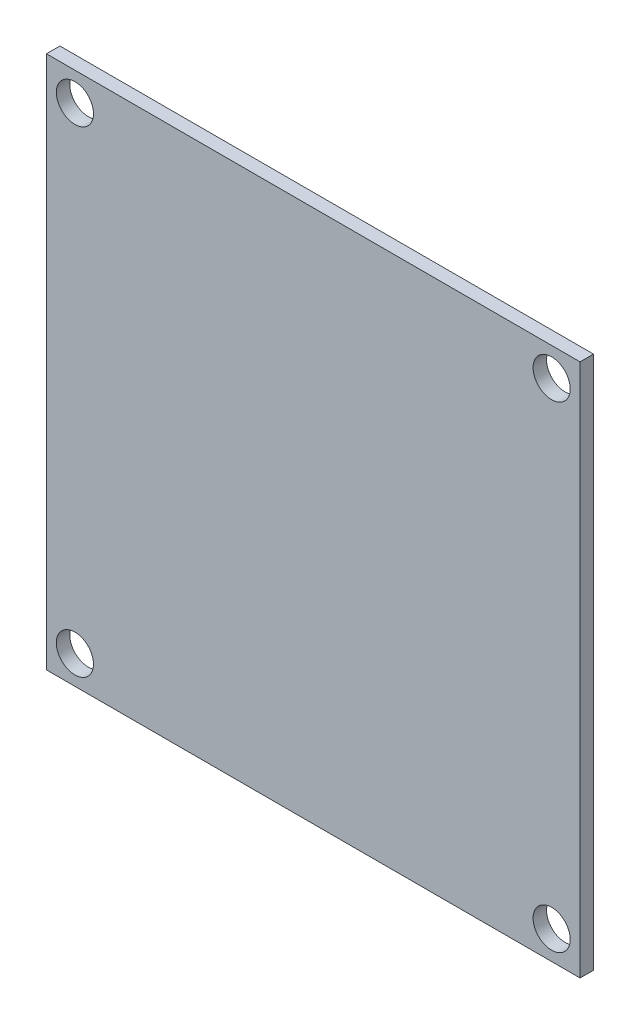
ISO-10303-21;
HEADER;
FILE_DESCRIPTION(('STEP AP214'),'2;1');
FILE_NAME('part.step','',(''),(''),'','','');
FILE_SCHEMA(('AUTOMOTIVE_DESIGN { 1 0 10303 214 1 1 1 1 }'));
ENDSEC;
DATA;
#1=APPLICATION_CONTEXT('core data for automotive mechanical design processes');
#2=APPLICATION_PROTOCOL_DEFINITION('international standard','automotive_design',2000,#1);
#3=PRODUCT_CONTEXT('',#1,'mechanical');
#4=PRODUCT('Part','Part','',(#3));
#5=PRODUCT_RELATED_PRODUCT_CATEGORY('part','',(#4));
#6=PRODUCT_DEFINITION_FORMATION('','',#4);
#7=PRODUCT_DEFINITION_CONTEXT('part definition',#1,'design');
#8=PRODUCT_DEFINITION('design','',#6,#7);
#9=PRODUCT_DEFINITION_SHAPE('','',#8);
#10=(LENGTH_UNIT() NAMED_UNIT(*) SI_UNIT(.MILLI.,.METRE.));
#11=(NAMED_UNIT(*) PLANE_ANGLE_UNIT() SI_UNIT($,.RADIAN.));
#12=(NAMED_UNIT(*) SI_UNIT($,.STERADIAN.) SOLID_ANGLE_UNIT());
#13=UNCERTAINTY_MEASURE_WITH_UNIT(LENGTH_MEASURE(1.E-05),#10,'distance_accuracy_value','');
#14=(GEOMETRIC_REPRESENTATION_CONTEXT(3) GLOBAL_UNCERTAINTY_ASSIGNED_CONTEXT((#13)) GLOBAL_UNIT_ASSIGNED_CONTEXT((#10,
#11,#12)) REPRESENTATION_CONTEXT('',''));
#15=CARTESIAN_POINT('',(0.,0.,0.));
#16=DIRECTION('',(0.,0.,1.));
#17=DIRECTION('',(1.,0.,0.));
#18=AXIS2_PLACEMENT_3D('',#15,#16,#17);
#19=CARTESIAN_POINT('',(25.1841,25.1841,1.27));
#20=DIRECTION('',(0.,0.,-1.));
#21=DIRECTION('',(-1.,0.,0.));
#22=AXIS2_PLACEMENT_3D('',#19,#20,#21);
#23=PLANE('',#22);
#24=CARTESIAN_POINT('',(-22.5,-22.5,1.27));
#25=DIRECTION('',(0.,0.,1.));
#26=DIRECTION('',(1.,0.,0.));
#27=AXIS2_PLACEMENT_3D('',#24,#25,#26);
#28=CIRCLE('',#27,1.7526);
#29=CARTESIAN_POINT('',(-20.7474,-22.5,1.27));
#30=VERTEX_POINT('',#29);
#31=EDGE_CURVE('E121',#30,#30,#28,.T.);
#32=ORIENTED_EDGE('',*,*,#31,.F.);
#33=EDGE_LOOP('',(#32));
#34=FACE_BOUND('',#33,.T.);
#35=CARTESIAN_POINT('',(-22.5,22.5,1.27));
#36=DIRECTION('',(0.,0.,1.));
#37=DIRECTION('',(1.,0.,0.));
#38=AXIS2_PLACEMENT_3D('',#35,#36,#37);
#39=CIRCLE('',#38,1.7526);
#40=CARTESIAN_POINT('',(-20.7474,22.5,1.27));
#41=VERTEX_POINT('',#40);
#42=EDGE_CURVE('E100',#41,#41,#39,.T.);
#43=ORIENTED_EDGE('',*,*,#42,.F.);
#44=EDGE_LOOP('',(#43));
#45=FACE_BOUND('',#44,.T.);
#46=DIRECTION('',(0.,1.,0.));
#47=VECTOR('',#46,1.);
#48=CARTESIAN_POINT('',(25.1841,-25.1841,1.27));
#49=LINE('',#48,#47);
#50=CARTESIAN_POINT('',(25.1841,-25.1841,1.27));
#51=VERTEX_POINT('',#50);
#52=CARTESIAN_POINT('',(25.1841,25.1841,1.27));
#53=VERTEX_POINT('',#52);
#54=EDGE_CURVE('E85',#51,#53,#49,.T.);
#55=ORIENTED_EDGE('',*,*,#54,.T.);
#56=DIRECTION('',(-1.,0.,0.));
#57=VECTOR('',#56,1.);
#58=CARTESIAN_POINT('',(-25.1841,25.1841,1.27));
#59=LINE('',#58,#57);
#60=CARTESIAN_POINT('',(-25.1841,25.1841,1.27));
#61=VERTEX_POINT('',#60);
#62=EDGE_CURVE('E80',#53,#61,#59,.T.);
#63=ORIENTED_EDGE('',*,*,#62,.T.);
#64=DIRECTION('',(0.,-1.,0.));
#65=VECTOR('',#64,1.);
#66=CARTESIAN_POINT('',(-25.1841,-25.1841,1.27));
#67=LINE('',#66,#65);
#68=CARTESIAN_POINT('',(-25.1841,-25.1841,1.27));
#69=VERTEX_POINT('',#68);
#70=EDGE_CURVE('E83',#61,#69,#67,.T.);
#71=ORIENTED_EDGE('',*,*,#70,.T.);
#72=DIRECTION('',(1.,0.,0.));
#73=VECTOR('',#72,1.);
#74=CARTESIAN_POINT('',(-25.1841,-25.1841,1.27));
#75=LINE('',#74,#73);
#76=EDGE_CURVE('E50',#69,#51,#75,.T.);
#77=ORIENTED_EDGE('',*,*,#76,.T.);
#78=EDGE_LOOP('',(#55,#63,#71,#77));
#79=FACE_BOUND('',#78,.T.);
#80=CARTESIAN_POINT('',(22.5,22.5,1.27));
#81=DIRECTION('',(0.,0.,1.));
#82=DIRECTION('',(1.,0.,0.));
#83=AXIS2_PLACEMENT_3D('',#80,#81,#82);
#84=CIRCLE('',#83,1.7526);
#85=CARTESIAN_POINT('',(24.2526,22.5,1.27));
#86=VERTEX_POINT('',#85);
#87=EDGE_CURVE('E115',#86,#86,#84,.T.);
#88=ORIENTED_EDGE('',*,*,#87,.F.);
#89=EDGE_LOOP('',(#88));
#90=FACE_BOUND('',#89,.T.);
#91=CARTESIAN_POINT('',(22.5,-22.5,1.27));
#92=DIRECTION('',(0.,0.,1.));
#93=DIRECTION('',(1.,0.,0.));
#94=AXIS2_PLACEMENT_3D('',#91,#92,#93);
#95=CIRCLE('',#94,1.7526);
#96=CARTESIAN_POINT('',(24.2526,-22.5,1.27));
#97=VERTEX_POINT('',#96);
#98=EDGE_CURVE('E127',#97,#97,#95,.T.);
#99=ORIENTED_EDGE('',*,*,#98,.F.);
#100=EDGE_LOOP('',(#99));
#101=FACE_BOUND('',#100,.T.);
#102=ADVANCED_FACE('F33',(#34,#45,#79,#90,#101),#23,.F.);
#103=CARTESIAN_POINT('',(25.1841,25.1841,0.));
#104=DIRECTION('',(0.,0.,-1.));
#105=DIRECTION('',(-1.,0.,0.));
#106=AXIS2_PLACEMENT_3D('',#103,#104,#105);
#107=PLANE('',#106);
#108=CARTESIAN_POINT('',(-22.5,-22.5,0.));
#109=DIRECTION('',(0.,0.,1.));
#110=DIRECTION('',(1.,0.,0.));
#111=AXIS2_PLACEMENT_3D('',#108,#109,#110);
#112=CIRCLE('',#111,1.7526);
#113=CARTESIAN_POINT('',(-20.7474,-22.5,0.));
#114=VERTEX_POINT('',#113);
#115=EDGE_CURVE('E124',#114,#114,#112,.T.);
#116=ORIENTED_EDGE('',*,*,#115,.T.);
#117=EDGE_LOOP('',(#116));
#118=FACE_BOUND('',#117,.T.);
#119=CARTESIAN_POINT('',(-22.5,22.5,0.));
#120=DIRECTION('',(0.,0.,1.));
#121=DIRECTION('',(1.,0.,0.));
#122=AXIS2_PLACEMENT_3D('',#119,#120,#121);
#123=CIRCLE('',#122,1.7526);
#124=CARTESIAN_POINT('',(-20.7474,22.5,0.));
#125=VERTEX_POINT('',#124);
#126=EDGE_CURVE('E112',#125,#125,#123,.T.);
#127=ORIENTED_EDGE('',*,*,#126,.T.);
#128=EDGE_LOOP('',(#127));
#129=FACE_BOUND('',#128,.T.);
#130=DIRECTION('',(0.,1.,0.));
#131=VECTOR('',#130,1.);
#132=CARTESIAN_POINT('',(25.1841,-25.1841,0.));
#133=LINE('',#132,#131);
#134=CARTESIAN_POINT('',(25.1841,-25.1841,0.));
#135=VERTEX_POINT('',#134);
#136=CARTESIAN_POINT('',(25.1841,25.1841,0.));
#137=VERTEX_POINT('',#136);
#138=EDGE_CURVE('E97',#135,#137,#133,.T.);
#139=ORIENTED_EDGE('',*,*,#138,.F.);
#140=DIRECTION('',(1.,0.,0.));
#141=VECTOR('',#140,1.);
#142=CARTESIAN_POINT('',(-25.1841,-25.1841,0.));
#143=LINE('',#142,#141);
#144=CARTESIAN_POINT('',(-25.1841,-25.1841,0.));
#145=VERTEX_POINT('',#144);
#146=EDGE_CURVE('E73',#145,#135,#143,.T.);
#147=ORIENTED_EDGE('',*,*,#146,.F.);
#148=DIRECTION('',(0.,-1.,0.));
#149=VECTOR('',#148,1.);
#150=CARTESIAN_POINT('',(-25.1841,-25.1841,0.));
#151=LINE('',#150,#149);
#152=CARTESIAN_POINT('',(-25.1841,25.1841,0.));
#153=VERTEX_POINT('',#152);
#154=EDGE_CURVE('E67',#153,#145,#151,.T.);
#155=ORIENTED_EDGE('',*,*,#154,.F.);
#156=DIRECTION('',(-1.,0.,0.));
#157=VECTOR('',#156,1.);
#158=CARTESIAN_POINT('',(-25.1841,25.1841,0.));
#159=LINE('',#158,#157);
#160=EDGE_CURVE('E89',#137,#153,#159,.T.);
#161=ORIENTED_EDGE('',*,*,#160,.F.);
#162=EDGE_LOOP('',(#139,#147,#155,#161));
#163=FACE_BOUND('',#162,.T.);
#164=CARTESIAN_POINT('',(22.5,22.5,0.));
#165=DIRECTION('',(0.,0.,1.));
#166=DIRECTION('',(1.,0.,0.));
#167=AXIS2_PLACEMENT_3D('',#164,#165,#166);
#168=CIRCLE('',#167,1.7526);
#169=CARTESIAN_POINT('',(24.2526,22.5,0.));
#170=VERTEX_POINT('',#169);
#171=EDGE_CURVE('E118',#170,#170,#168,.T.);
#172=ORIENTED_EDGE('',*,*,#171,.T.);
#173=EDGE_LOOP('',(#172));
#174=FACE_BOUND('',#173,.T.);
#175=CARTESIAN_POINT('',(22.5,-22.5,0.));
#176=DIRECTION('',(0.,0.,1.));
#177=DIRECTION('',(1.,0.,0.));
#178=AXIS2_PLACEMENT_3D('',#175,#176,#177);
#179=CIRCLE('',#178,1.7526);
#180=CARTESIAN_POINT('',(24.2526,-22.5,0.));
#181=VERTEX_POINT('',#180);
#182=EDGE_CURVE('E130',#181,#181,#179,.T.);
#183=ORIENTED_EDGE('',*,*,#182,.T.);
#184=EDGE_LOOP('',(#183));
#185=FACE_BOUND('',#184,.T.);
#186=ADVANCED_FACE('F108',(#118,#129,#163,#174,#185),#107,.T.);
#187=CARTESIAN_POINT('',(25.1841,-25.1841,1.27));
#188=DIRECTION('',(-1.,0.,0.));
#189=DIRECTION('',(0.,0.,1.));
#190=AXIS2_PLACEMENT_3D('',#187,#188,#189);
#191=PLANE('',#190);
#192=ORIENTED_EDGE('',*,*,#138,.T.);
#193=DIRECTION('',(0.,0.,-1.));
#194=VECTOR('',#193,1.);
#195=CARTESIAN_POINT('',(25.1841,25.1841,1.27));
#196=LINE('',#195,#194);
#197=EDGE_CURVE('E11',#53,#137,#196,.T.);
#198=ORIENTED_EDGE('',*,*,#197,.F.);
#199=ORIENTED_EDGE('',*,*,#54,.F.);
#200=DIRECTION('',(0.,0.,-1.));
#201=VECTOR('',#200,1.);
#202=CARTESIAN_POINT('',(25.1841,-25.1841,1.27));
#203=LINE('',#202,#201);
#204=EDGE_CURVE('E93',#51,#135,#203,.T.);
#205=ORIENTED_EDGE('',*,*,#204,.T.);
#206=EDGE_LOOP('',(#192,#198,#199,#205));
#207=FACE_BOUND('',#206,.T.);
#208=ADVANCED_FACE('F35',(#207),#191,.F.);
#209=CARTESIAN_POINT('',(-25.1841,25.1841,1.27));
#210=DIRECTION('',(0.,-1.,0.));
#211=DIRECTION('',(0.,0.,-1.));
#212=AXIS2_PLACEMENT_3D('',#209,#210,#211);
#213=PLANE('',#212);
#214=ORIENTED_EDGE('',*,*,#160,.T.);
#215=DIRECTION('',(0.,0.,-1.));
#216=VECTOR('',#215,1.);
#217=CARTESIAN_POINT('',(-25.1841,25.1841,1.27));
#218=LINE('',#217,#216);
#219=EDGE_CURVE('E42',#61,#153,#218,.T.);
#220=ORIENTED_EDGE('',*,*,#219,.F.);
#221=ORIENTED_EDGE('',*,*,#62,.F.);
#222=ORIENTED_EDGE('',*,*,#197,.T.);
#223=EDGE_LOOP('',(#214,#220,#221,#222));
#224=FACE_BOUND('',#223,.T.);
#225=ADVANCED_FACE('F88',(#224),#213,.F.);
#226=CARTESIAN_POINT('',(-25.1841,-25.1841,1.27));
#227=DIRECTION('',(1.,0.,0.));
#228=DIRECTION('',(0.,0.,-1.));
#229=AXIS2_PLACEMENT_3D('',#226,#227,#228);
#230=PLANE('',#229);
#231=ORIENTED_EDGE('',*,*,#154,.T.);
#232=DIRECTION('',(0.,0.,-1.));
#233=VECTOR('',#232,1.);
#234=CARTESIAN_POINT('',(-25.1841,-25.1841,1.27));
#235=LINE('',#234,#233);
#236=EDGE_CURVE('E90',#69,#145,#235,.T.);
#237=ORIENTED_EDGE('',*,*,#236,.F.);
#238=ORIENTED_EDGE('',*,*,#70,.F.);
#239=ORIENTED_EDGE('',*,*,#219,.T.);
#240=EDGE_LOOP('',(#231,#237,#238,#239));
#241=FACE_BOUND('',#240,.T.);
#242=ADVANCED_FACE('F91',(#241),#230,.F.);
#243=CARTESIAN_POINT('',(-25.1841,-25.1841,1.27));
#244=DIRECTION('',(0.,1.,0.));
#245=DIRECTION('',(0.,0.,1.));
#246=AXIS2_PLACEMENT_3D('',#243,#244,#245);
#247=PLANE('',#246);
#248=ORIENTED_EDGE('',*,*,#146,.T.);
#249=ORIENTED_EDGE('',*,*,#204,.F.);
#250=ORIENTED_EDGE('',*,*,#76,.F.);
#251=ORIENTED_EDGE('',*,*,#236,.T.);
#252=EDGE_LOOP('',(#248,#249,#250,#251));
#253=FACE_BOUND('',#252,.T.);
#254=ADVANCED_FACE('F105',(#253),#247,.F.);
#255=CARTESIAN_POINT('',(-22.5,22.5,1.27));
#256=DIRECTION('',(0.,0.,-1.));
#257=DIRECTION('',(-1.,0.,0.));
#258=AXIS2_PLACEMENT_3D('',#255,#256,#257);
#259=CYLINDRICAL_SURFACE('',#258,1.7526);
#260=ORIENTED_EDGE('',*,*,#42,.T.);
#261=EDGE_LOOP('',(#260));
#262=FACE_BOUND('',#261,.T.);
#263=ORIENTED_EDGE('',*,*,#126,.F.);
#264=EDGE_LOOP('',(#263));
#265=FACE_BOUND('',#264,.T.);
#266=ADVANCED_FACE('F150',(#262,#265),#259,.F.);
#267=CARTESIAN_POINT('',(22.5,22.5,1.27));
#268=DIRECTION('',(0.,0.,-1.));
#269=DIRECTION('',(-1.,0.,0.));
#270=AXIS2_PLACEMENT_3D('',#267,#268,#269);
#271=CYLINDRICAL_SURFACE('',#270,1.7526);
#272=ORIENTED_EDGE('',*,*,#87,.T.);
#273=EDGE_LOOP('',(#272));
#274=FACE_BOUND('',#273,.T.);
#275=ORIENTED_EDGE('',*,*,#171,.F.);
#276=EDGE_LOOP('',(#275));
#277=FACE_BOUND('',#276,.T.);
#278=ADVANCED_FACE('F196',(#274,#277),#271,.F.);
#279=CARTESIAN_POINT('',(-22.5,-22.5,1.27));
#280=DIRECTION('',(0.,0.,-1.));
#281=DIRECTION('',(-1.,0.,0.));
#282=AXIS2_PLACEMENT_3D('',#279,#280,#281);
#283=CYLINDRICAL_SURFACE('',#282,1.7526);
#284=ORIENTED_EDGE('',*,*,#31,.T.);
#285=EDGE_LOOP('',(#284));
#286=FACE_BOUND('',#285,.T.);
#287=ORIENTED_EDGE('',*,*,#115,.F.);
#288=EDGE_LOOP('',(#287));
#289=FACE_BOUND('',#288,.T.);
#290=ADVANCED_FACE('F204',(#286,#289),#283,.F.);
#291=CARTESIAN_POINT('',(22.5,-22.5,1.27));
#292=DIRECTION('',(0.,0.,-1.));
#293=DIRECTION('',(-1.,0.,0.));
#294=AXIS2_PLACEMENT_3D('',#291,#292,#293);
#295=CYLINDRICAL_SURFACE('',#294,1.7526);
#296=ORIENTED_EDGE('',*,*,#98,.T.);
#297=EDGE_LOOP('',(#296));
#298=FACE_BOUND('',#297,.T.);
#299=ORIENTED_EDGE('',*,*,#182,.F.);
#300=EDGE_LOOP('',(#299));
#301=FACE_BOUND('',#300,.T.);
#302=ADVANCED_FACE('F136',(#298,#301),#295,.F.);
#303=CLOSED_SHELL('',(#102,#186,#208,#225,#242,#254,#266,#278,#290,#302));
#304=MANIFOLD_SOLID_BREP('B2',#303);
#305=ADVANCED_BREP_SHAPE_REPRESENTATION('',(#18,#304),#14);
#306=SHAPE_DEFINITION_REPRESENTATION(#9,#305);
ENDSEC;
END-ISO-10303-21;
